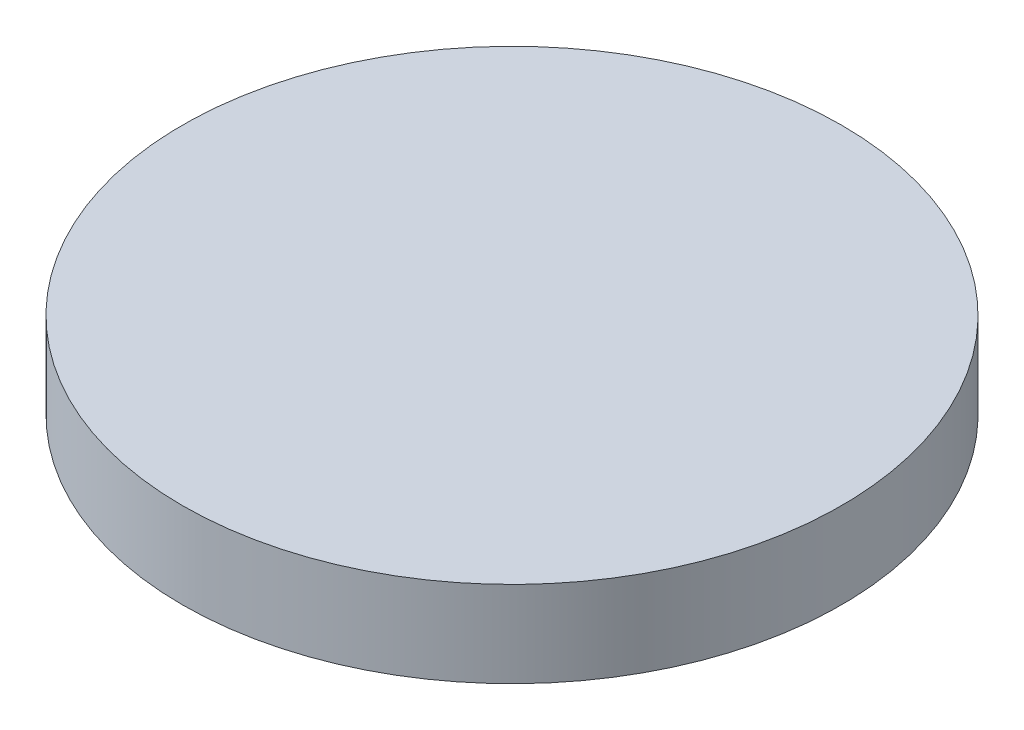
ISO-10303-21;
HEADER;
FILE_DESCRIPTION(('STEP AP214'),'2;1');
FILE_NAME('part.step','',(''),(''),'','','');
FILE_SCHEMA(('AUTOMOTIVE_DESIGN { 1 0 10303 214 1 1 1 1 }'));
ENDSEC;
DATA;
#1=APPLICATION_CONTEXT('core data for automotive mechanical design processes');
#2=APPLICATION_PROTOCOL_DEFINITION('international standard','automotive_design',2000,#1);
#3=PRODUCT_CONTEXT('',#1,'mechanical');
#4=PRODUCT('Part','Part','',(#3));
#5=PRODUCT_RELATED_PRODUCT_CATEGORY('part','',(#4));
#6=PRODUCT_DEFINITION_FORMATION('','',#4);
#7=PRODUCT_DEFINITION_CONTEXT('part definition',#1,'design');
#8=PRODUCT_DEFINITION('design','',#6,#7);
#9=PRODUCT_DEFINITION_SHAPE('','',#8);
#10=(LENGTH_UNIT() NAMED_UNIT(*) SI_UNIT(.MILLI.,.METRE.));
#11=(NAMED_UNIT(*) PLANE_ANGLE_UNIT() SI_UNIT($,.RADIAN.));
#12=(NAMED_UNIT(*) SI_UNIT($,.STERADIAN.) SOLID_ANGLE_UNIT());
#13=UNCERTAINTY_MEASURE_WITH_UNIT(LENGTH_MEASURE(1.E-05),#10,'distance_accuracy_value','');
#14=(GEOMETRIC_REPRESENTATION_CONTEXT(3) GLOBAL_UNCERTAINTY_ASSIGNED_CONTEXT((#13)) GLOBAL_UNIT_ASSIGNED_CONTEXT((#10,
#11,#12)) REPRESENTATION_CONTEXT('',''));
#15=CARTESIAN_POINT('',(0.,0.,0.));
#16=DIRECTION('',(0.,0.,1.));
#17=DIRECTION('',(1.,0.,0.));
#18=AXIS2_PLACEMENT_3D('',#15,#16,#17);
#19=CARTESIAN_POINT('',(0.,3.,0.));
#20=DIRECTION('',(0.,-1.,0.));
#21=DIRECTION('',(0.,0.,-1.));
#22=AXIS2_PLACEMENT_3D('',#19,#20,#21);
#23=CYLINDRICAL_SURFACE('',#22,11.5);
#24=CARTESIAN_POINT('',(0.,3.,0.));
#25=DIRECTION('',(0.,1.,0.));
#26=DIRECTION('',(0.,0.,1.));
#27=AXIS2_PLACEMENT_3D('',#24,#25,#26);
#28=CIRCLE('',#27,11.5);
#29=CARTESIAN_POINT('',(0.,3.,11.5));
#30=VERTEX_POINT('',#29);
#31=EDGE_CURVE('E10',#30,#30,#28,.T.);
#32=ORIENTED_EDGE('',*,*,#31,.F.);
#33=EDGE_LOOP('',(#32));
#34=FACE_BOUND('',#33,.T.);
#35=CARTESIAN_POINT('',(0.,0.,0.));
#36=DIRECTION('',(0.,1.,0.));
#37=DIRECTION('',(0.,0.,1.));
#38=AXIS2_PLACEMENT_3D('',#35,#36,#37);
#39=CIRCLE('',#38,11.5);
#40=CARTESIAN_POINT('',(0.,0.,11.5));
#41=VERTEX_POINT('',#40);
#42=EDGE_CURVE('E35',#41,#41,#39,.T.);
#43=ORIENTED_EDGE('',*,*,#42,.T.);
#44=EDGE_LOOP('',(#43));
#45=FACE_BOUND('',#44,.T.);
#46=ADVANCED_FACE('F32',(#34,#45),#23,.T.);
#47=CARTESIAN_POINT('',(0.,3.,0.));
#48=DIRECTION('',(0.,1.,0.));
#49=DIRECTION('',(0.,0.,1.));
#50=AXIS2_PLACEMENT_3D('',#47,#48,#49);
#51=PLANE('',#50);
#52=ORIENTED_EDGE('',*,*,#31,.T.);
#53=EDGE_LOOP('',(#52));
#54=FACE_BOUND('',#53,.T.);
#55=ADVANCED_FACE('F47',(#54),#51,.T.);
#56=CARTESIAN_POINT('',(0.,0.,0.));
#57=DIRECTION('',(0.,1.,0.));
#58=DIRECTION('',(0.,0.,1.));
#59=AXIS2_PLACEMENT_3D('',#56,#57,#58);
#60=PLANE('',#59);
#61=ORIENTED_EDGE('',*,*,#42,.F.);
#62=EDGE_LOOP('',(#61));
#63=FACE_BOUND('',#62,.T.);
#64=ADVANCED_FACE('F45',(#63),#60,.F.);
#65=CLOSED_SHELL('',(#46,#55,#64));
#66=MANIFOLD_SOLID_BREP('B2',#65);
#67=ADVANCED_BREP_SHAPE_REPRESENTATION('',(#18,#66),#14);
#68=SHAPE_DEFINITION_REPRESENTATION(#9,#67);
ENDSEC;
END-ISO-10303-21;
